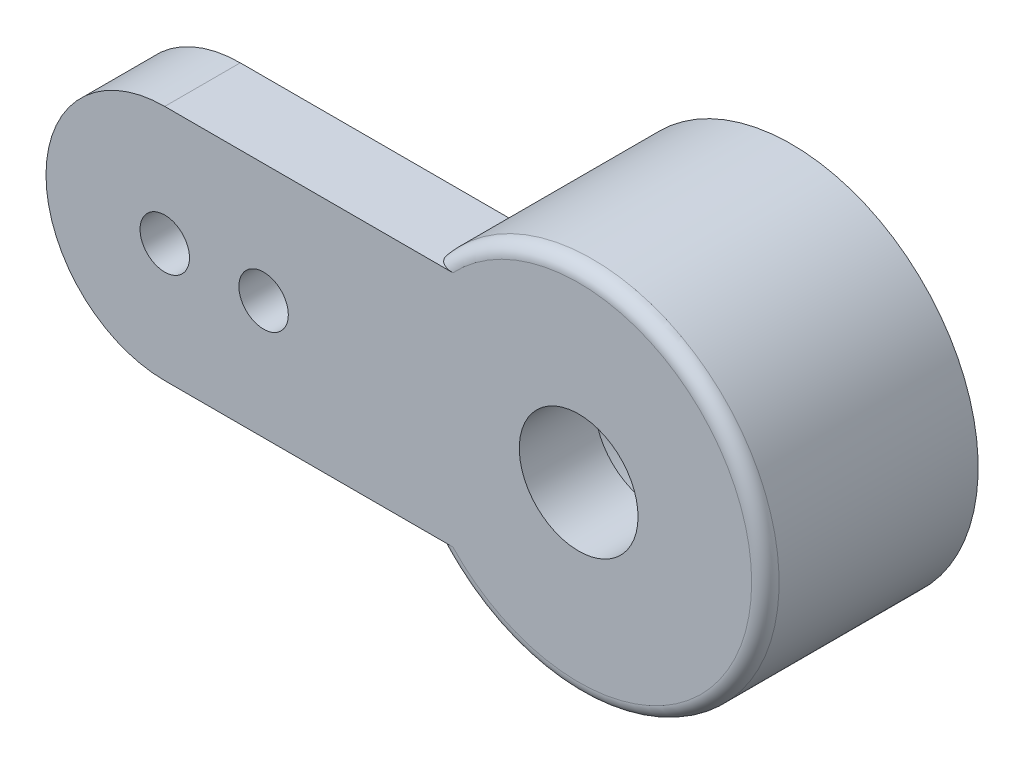
ISO-10303-21;
HEADER;
FILE_DESCRIPTION(('STEP AP214'),'2;1');
FILE_NAME('part.step','',(''),(''),'','','');
FILE_SCHEMA(('AUTOMOTIVE_DESIGN { 1 0 10303 214 1 1 1 1 }'));
ENDSEC;
DATA;
#1=APPLICATION_CONTEXT('core data for automotive mechanical design processes');
#2=APPLICATION_PROTOCOL_DEFINITION('international standard','automotive_design',2000,#1);
#3=PRODUCT_CONTEXT('',#1,'mechanical');
#4=PRODUCT('Part','Part','',(#3));
#5=PRODUCT_RELATED_PRODUCT_CATEGORY('part','',(#4));
#6=PRODUCT_DEFINITION_FORMATION('','',#4);
#7=PRODUCT_DEFINITION_CONTEXT('part definition',#1,'design');
#8=PRODUCT_DEFINITION('design','',#6,#7);
#9=PRODUCT_DEFINITION_SHAPE('','',#8);
#10=(LENGTH_UNIT() NAMED_UNIT(*) SI_UNIT(.MILLI.,.METRE.));
#11=(NAMED_UNIT(*) PLANE_ANGLE_UNIT() SI_UNIT($,.RADIAN.));
#12=(NAMED_UNIT(*) SI_UNIT($,.STERADIAN.) SOLID_ANGLE_UNIT());
#13=UNCERTAINTY_MEASURE_WITH_UNIT(LENGTH_MEASURE(1.E-05),#10,'distance_accuracy_value','');
#14=(GEOMETRIC_REPRESENTATION_CONTEXT(3) GLOBAL_UNCERTAINTY_ASSIGNED_CONTEXT((#13)) GLOBAL_UNIT_ASSIGNED_CONTEXT((#10,
#11,#12)) REPRESENTATION_CONTEXT('',''));
#15=CARTESIAN_POINT('',(0.,0.,0.));
#16=DIRECTION('',(0.,0.,1.));
#17=DIRECTION('',(1.,0.,0.));
#18=AXIS2_PLACEMENT_3D('',#15,#16,#17);
#19=CARTESIAN_POINT('',(0.,0.,0.));
#20=DIRECTION('',(0.,0.,1.));
#21=DIRECTION('',(1.,0.,0.));
#22=AXIS2_PLACEMENT_3D('',#19,#20,#21);
#23=PLANE('',#22);
#24=CARTESIAN_POINT('',(0.,0.,0.));
#25=DIRECTION('',(0.,0.,1.));
#26=DIRECTION('',(1.,0.,0.));
#27=AXIS2_PLACEMENT_3D('',#24,#25,#26);
#28=CIRCLE('',#27,0.865);
#29=CARTESIAN_POINT('',(0.865,0.,0.));
#30=VERTEX_POINT('',#29);
#31=EDGE_CURVE('E123',#30,#30,#28,.T.);
#32=ORIENTED_EDGE('',*,*,#31,.T.);
#33=EDGE_LOOP('',(#32));
#34=FACE_BOUND('',#33,.T.);
#35=CARTESIAN_POINT('',(0.,0.,0.));
#36=DIRECTION('',(0.,0.,-1.));
#37=DIRECTION('',(-1.,0.,0.));
#38=AXIS2_PLACEMENT_3D('',#35,#36,#37);
#39=CIRCLE('',#38,1.95);
#40=CARTESIAN_POINT('',(-1.95,0.,0.));
#41=VERTEX_POINT('',#40);
#42=EDGE_CURVE('E206',#41,#41,#39,.T.);
#43=ORIENTED_EDGE('',*,*,#42,.T.);
#44=EDGE_LOOP('',(#43));
#45=FACE_BOUND('',#44,.T.);
#46=ADVANCED_FACE('F37',(#34,#45),#23,.F.);
#47=CARTESIAN_POINT('',(0.,1.73,1.1));
#48=DIRECTION('',(0.,1.,0.));
#49=DIRECTION('',(0.,0.,1.));
#50=AXIS2_PLACEMENT_3D('',#47,#48,#49);
#51=PLANE('',#50);
#52=DIRECTION('',(1.,0.,0.));
#53=VECTOR('',#52,1.);
#54=CARTESIAN_POINT('',(0.,1.73,0.));
#55=LINE('',#54,#53);
#56=CARTESIAN_POINT('',(-6.03,1.73,0.));
#57=VERTEX_POINT('',#56);
#58=CARTESIAN_POINT('',(-2.09892829796542,1.73,0.));
#59=VERTEX_POINT('',#58);
#60=EDGE_CURVE('E90',#57,#59,#55,.T.);
#61=ORIENTED_EDGE('',*,*,#60,.F.);
#62=DIRECTION('',(0.,0.,-1.));
#63=VECTOR('',#62,1.);
#64=CARTESIAN_POINT('',(-6.03,1.73,1.1));
#65=LINE('',#64,#63);
#66=CARTESIAN_POINT('',(-6.03,1.73,1.1));
#67=VERTEX_POINT('',#66);
#68=EDGE_CURVE('E109',#67,#57,#65,.T.);
#69=ORIENTED_EDGE('',*,*,#68,.F.);
#70=DIRECTION('',(1.,0.,0.));
#71=VECTOR('',#70,1.);
#72=CARTESIAN_POINT('',(0.,1.73,1.1));
#73=LINE('',#72,#71);
#74=CARTESIAN_POINT('',(-1.83234822018087,1.73,1.1));
#75=VERTEX_POINT('',#74);
#76=EDGE_CURVE('E126',#67,#75,#73,.T.);
#77=ORIENTED_EDGE('',*,*,#76,.T.);
#78=CARTESIAN_POINT('',(-1.83234822018087,1.73,1.1));
#79=CARTESIAN_POINT('',(-1.84914862660356,1.73,1.09999170349791));
#80=CARTESIAN_POINT('',(-1.86598354058604,1.73,1.09887886358776));
#81=CARTESIAN_POINT('',(-1.89945426657358,1.73,1.0942693752675));
#82=CARTESIAN_POINT('',(-1.91608746178577,1.73,1.09075399873377));
#83=CARTESIAN_POINT('',(-1.94688393669079,1.73,1.08166863961151));
#84=CARTESIAN_POINT('',(-1.96112204568059,1.73,1.07635618537872));
#85=CARTESIAN_POINT('',(-1.98855857451408,1.73,1.06354998524682));
#86=CARTESIAN_POINT('',(-2.00175982236996,1.73,1.05606245431255));
#87=CARTESIAN_POINT('',(-2.02381370815452,1.73,1.04072758823927));
#88=CARTESIAN_POINT('',(-2.0329798322836,1.73,1.03333228102285));
#89=CARTESIAN_POINT('',(-2.05000748342378,1.73,1.01715625888905));
#90=CARTESIAN_POINT('',(-2.05787009745671,1.73,1.00837671036032));
#91=CARTESIAN_POINT('',(-2.07066102906721,1.73,0.991156281053392));
#92=CARTESIAN_POINT('',(-2.07586154032636,1.73,0.982918098762003));
#93=CARTESIAN_POINT('',(-2.08482175505333,1.73,0.965699043857486));
#94=CARTESIAN_POINT('',(-2.08858403669946,1.73,0.956719535633482));
#95=CARTESIAN_POINT('',(-2.09393995828107,1.73,0.939827230950006));
#96=CARTESIAN_POINT('',(-2.09579558274631,1.73,0.931997262682997));
#97=CARTESIAN_POINT('',(-2.09829696916454,1.73,0.916115281847677));
#98=CARTESIAN_POINT('',(-2.09893783168279,1.73,0.90806250244352));
#99=CARTESIAN_POINT('',(-2.09892829796542,1.73,0.9));
#100=B_SPLINE_CURVE_WITH_KNOTS('',3,(#78,#79,#80,#81,#82,#83,#84,#85,#86,#87,#88,#89,#90,#91,
#92,#93,#94,#95,#96,#97,#98,#99),.UNSPECIFIED.,.F.,.F.,(4,2,2,2,2,2,2,2,2,2,4),(0.,
0.0504208658360562,0.101239321133232,0.146666640187053,0.191965413023909,0.227169368092908,
0.26234381661386,0.29145234353568,0.32050844289208,0.344557526311704,0.368703400927188),.UNSPECIFIED.);
#101=CARTESIAN_POINT('',(-2.09892829796542,1.73,0.9));
#102=VERTEX_POINT('',#101);
#103=EDGE_CURVE('E51',#75,#102,#100,.T.);
#104=ORIENTED_EDGE('',*,*,#103,.T.);
#105=DIRECTION('',(0.,0.,-1.));
#106=VECTOR('',#105,1.);
#107=CARTESIAN_POINT('',(-2.09892829796542,1.73,1.1));
#108=LINE('',#107,#106);
#109=EDGE_CURVE('E87',#102,#59,#108,.T.);
#110=ORIENTED_EDGE('',*,*,#109,.T.);
#111=EDGE_LOOP('',(#61,#69,#77,#104,#110));
#112=FACE_BOUND('',#111,.T.);
#113=ADVANCED_FACE('F89',(#112),#51,.T.);
#114=CARTESIAN_POINT('',(-6.03,0.,1.1));
#115=DIRECTION('',(0.,0.,-1.));
#116=DIRECTION('',(-1.,0.,0.));
#117=AXIS2_PLACEMENT_3D('',#114,#115,#116);
#118=CYLINDRICAL_SURFACE('',#117,1.73);
#119=CARTESIAN_POINT('',(-6.03,0.,0.));
#120=DIRECTION('',(0.,0.,1.));
#121=DIRECTION('',(1.,0.,0.));
#122=AXIS2_PLACEMENT_3D('',#119,#120,#121);
#123=CIRCLE('',#122,1.73);
#124=CARTESIAN_POINT('',(-6.03,-1.73,0.));
#125=VERTEX_POINT('',#124);
#126=EDGE_CURVE('E103',#57,#125,#123,.T.);
#127=ORIENTED_EDGE('',*,*,#126,.T.);
#128=DIRECTION('',(0.,0.,-1.));
#129=VECTOR('',#128,1.);
#130=CARTESIAN_POINT('',(-6.03,-1.73,1.1));
#131=LINE('',#130,#129);
#132=CARTESIAN_POINT('',(-6.03,-1.73,1.1));
#133=VERTEX_POINT('',#132);
#134=EDGE_CURVE('E113',#133,#125,#131,.T.);
#135=ORIENTED_EDGE('',*,*,#134,.F.);
#136=CARTESIAN_POINT('',(-6.03,0.,1.1));
#137=DIRECTION('',(0.,0.,1.));
#138=DIRECTION('',(1.,0.,0.));
#139=AXIS2_PLACEMENT_3D('',#136,#137,#138);
#140=CIRCLE('',#139,1.73);
#141=EDGE_CURVE('E128',#67,#133,#140,.T.);
#142=ORIENTED_EDGE('',*,*,#141,.F.);
#143=ORIENTED_EDGE('',*,*,#68,.T.);
#144=EDGE_LOOP('',(#127,#135,#142,#143));
#145=FACE_BOUND('',#144,.T.);
#146=ADVANCED_FACE('F157',(#145),#118,.T.);
#147=CARTESIAN_POINT('',(0.,-1.73,1.1));
#148=DIRECTION('',(0.,1.,0.));
#149=DIRECTION('',(0.,0.,1.));
#150=AXIS2_PLACEMENT_3D('',#147,#148,#149);
#151=PLANE('',#150);
#152=DIRECTION('',(1.,0.,0.));
#153=VECTOR('',#152,1.);
#154=CARTESIAN_POINT('',(0.,-1.73,0.));
#155=LINE('',#154,#153);
#156=CARTESIAN_POINT('',(-2.09892829796542,-1.73,0.));
#157=VERTEX_POINT('',#156);
#158=EDGE_CURVE('E141',#125,#157,#155,.T.);
#159=ORIENTED_EDGE('',*,*,#158,.T.);
#160=DIRECTION('',(0.,0.,-1.));
#161=VECTOR('',#160,1.);
#162=CARTESIAN_POINT('',(-2.09892829796542,-1.73,1.1));
#163=LINE('',#162,#161);
#164=CARTESIAN_POINT('',(-2.09892829796542,-1.73,0.9));
#165=VERTEX_POINT('',#164);
#166=EDGE_CURVE('E92',#165,#157,#163,.T.);
#167=ORIENTED_EDGE('',*,*,#166,.F.);
#168=CARTESIAN_POINT('',(-2.09892829796542,-1.73,0.9));
#169=CARTESIAN_POINT('',(-2.09894642841829,-1.73,0.90940969495881));
#170=CARTESIAN_POINT('',(-2.09806905881191,-1.73,0.918802758006831));
#171=CARTESIAN_POINT('',(-2.0946758814639,-1.73,0.937226554673891));
#172=CARTESIAN_POINT('',(-2.09217094148231,-1.73,0.946259272793966));
#173=CARTESIAN_POINT('',(-2.08567729700475,-1.73,0.963749490273431));
#174=CARTESIAN_POINT('',(-2.08169118515068,-1.73,0.972207964371113));
#175=CARTESIAN_POINT('',(-2.07244822292569,-1.73,0.988408280201508));
#176=CARTESIAN_POINT('',(-2.06718926098548,-1.73,0.996148901240847));
#177=CARTESIAN_POINT('',(-2.05382878015789,-1.73,1.01307583691014));
#178=CARTESIAN_POINT('',(-2.04535154911743,-1.73,1.02196568840709));
#179=CARTESIAN_POINT('',(-2.02706406694268,-1.73,1.03824045590286));
#180=CARTESIAN_POINT('',(-2.01725203200275,-1.73,1.04562332441246));
#181=CARTESIAN_POINT('',(-1.99355345706409,-1.73,1.06091074507727));
#182=CARTESIAN_POINT('',(-1.97933289310105,-1.73,1.0682961495201));
#183=CARTESIAN_POINT('',(-1.94987568072068,-1.73,1.0806830500352));
#184=CARTESIAN_POINT('',(-1.93463673885815,-1.73,1.0856789434336));
#185=CARTESIAN_POINT('',(-1.90490583729894,-1.73,1.09311048801964));
#186=CARTESIAN_POINT('',(-1.89045728850669,-1.73,1.09572463834563));
#187=CARTESIAN_POINT('',(-1.8614494778074,-1.73,1.09916040803448));
#188=CARTESIAN_POINT('',(-1.84689171477545,-1.73,1.09999453603148));
#189=CARTESIAN_POINT('',(-1.83234822018087,-1.73,1.1));
#190=B_SPLINE_CURVE_WITH_KNOTS('',3,(#168,#169,#170,#171,#172,#173,#174,#175,#176,#177,#178,
#179,#180,#181,#182,#183,#184,#185,#186,#187,#188,#189),.UNSPECIFIED.,.F.,.F.,(4,2,2,2,2,2,2,2,
2,2,4),(0.,0.0281619305193012,0.0561377217742335,0.0840647731517108,0.112038474982948,
0.148690314604594,0.185391625208961,0.233207897682934,0.281135741688055,0.325074055030522,
0.368702572715453),.UNSPECIFIED.);
#191=CARTESIAN_POINT('',(-1.83234822018087,-1.73,1.1));
#192=VERTEX_POINT('',#191);
#193=EDGE_CURVE('E11',#165,#192,#190,.T.);
#194=ORIENTED_EDGE('',*,*,#193,.T.);
#195=DIRECTION('',(1.,0.,0.));
#196=VECTOR('',#195,1.);
#197=CARTESIAN_POINT('',(0.,-1.73,1.1));
#198=LINE('',#197,#196);
#199=EDGE_CURVE('E131',#133,#192,#198,.T.);
#200=ORIENTED_EDGE('',*,*,#199,.F.);
#201=ORIENTED_EDGE('',*,*,#134,.T.);
#202=EDGE_LOOP('',(#159,#167,#194,#200,#201));
#203=FACE_BOUND('',#202,.T.);
#204=ADVANCED_FACE('F212',(#203),#151,.F.);
#205=CARTESIAN_POINT('',(0.,0.,1.1));
#206=DIRECTION('',(0.,0.,-1.));
#207=DIRECTION('',(-1.,0.,0.));
#208=AXIS2_PLACEMENT_3D('',#205,#206,#207);
#209=CYLINDRICAL_SURFACE('',#208,2.72);
#210=ORIENTED_EDGE('',*,*,#109,.F.);
#211=CARTESIAN_POINT('',(0.,0.,0.9));
#212=DIRECTION('',(0.,0.,1.));
#213=DIRECTION('',(1.,0.,0.));
#214=AXIS2_PLACEMENT_3D('',#211,#212,#213);
#215=CIRCLE('',#214,2.72);
#216=EDGE_CURVE('E64',#102,#165,#215,.F.);
#217=ORIENTED_EDGE('',*,*,#216,.T.);
#218=ORIENTED_EDGE('',*,*,#166,.T.);
#219=CARTESIAN_POINT('',(0.,0.,0.));
#220=DIRECTION('',(0.,0.,-1.));
#221=DIRECTION('',(-1.,0.,0.));
#222=AXIS2_PLACEMENT_3D('',#219,#220,#221);
#223=CIRCLE('',#222,2.72);
#224=EDGE_CURVE('E100',#157,#59,#223,.T.);
#225=ORIENTED_EDGE('',*,*,#224,.T.);
#226=EDGE_LOOP('',(#210,#217,#218,#225));
#227=FACE_BOUND('',#226,.T.);
#228=CARTESIAN_POINT('',(0.,0.,-2.));
#229=DIRECTION('',(0.,0.,-1.));
#230=DIRECTION('',(-1.,0.,0.));
#231=AXIS2_PLACEMENT_3D('',#228,#229,#230);
#232=CIRCLE('',#231,2.72);
#233=CARTESIAN_POINT('',(-2.72,0.,-2.));
#234=VERTEX_POINT('',#233);
#235=EDGE_CURVE('E117',#234,#234,#232,.T.);
#236=ORIENTED_EDGE('',*,*,#235,.F.);
#237=EDGE_LOOP('',(#236));
#238=FACE_BOUND('',#237,.T.);
#239=ADVANCED_FACE('F106',(#227,#238),#209,.T.);
#240=CARTESIAN_POINT('',(-6.03,0.,1.1));
#241=DIRECTION('',(0.,0.,-1.));
#242=DIRECTION('',(-1.,0.,0.));
#243=AXIS2_PLACEMENT_3D('',#240,#241,#242);
#244=CYLINDRICAL_SURFACE('',#243,0.36);
#245=CARTESIAN_POINT('',(-6.03,0.,1.1));
#246=DIRECTION('',(0.,0.,1.));
#247=DIRECTION('',(1.,0.,0.));
#248=AXIS2_PLACEMENT_3D('',#245,#246,#247);
#249=CIRCLE('',#248,0.36);
#250=CARTESIAN_POINT('',(-5.67,0.,1.1));
#251=VERTEX_POINT('',#250);
#252=EDGE_CURVE('E122',#251,#251,#249,.T.);
#253=ORIENTED_EDGE('',*,*,#252,.T.);
#254=EDGE_LOOP('',(#253));
#255=FACE_BOUND('',#254,.T.);
#256=CARTESIAN_POINT('',(-6.03,0.,0.));
#257=DIRECTION('',(0.,0.,1.));
#258=DIRECTION('',(1.,0.,0.));
#259=AXIS2_PLACEMENT_3D('',#256,#257,#258);
#260=CIRCLE('',#259,0.36);
#261=CARTESIAN_POINT('',(-5.67,0.,0.));
#262=VERTEX_POINT('',#261);
#263=EDGE_CURVE('E104',#262,#262,#260,.T.);
#264=ORIENTED_EDGE('',*,*,#263,.F.);
#265=EDGE_LOOP('',(#264));
#266=FACE_BOUND('',#265,.T.);
#267=ADVANCED_FACE('F158',(#255,#266),#244,.F.);
#268=CARTESIAN_POINT('',(-4.59,0.,1.1));
#269=DIRECTION('',(0.,0.,-1.));
#270=DIRECTION('',(-1.,0.,0.));
#271=AXIS2_PLACEMENT_3D('',#268,#269,#270);
#272=CYLINDRICAL_SURFACE('',#271,0.36);
#273=CARTESIAN_POINT('',(-4.59,0.,1.1));
#274=DIRECTION('',(0.,0.,1.));
#275=DIRECTION('',(1.,0.,0.));
#276=AXIS2_PLACEMENT_3D('',#273,#274,#275);
#277=CIRCLE('',#276,0.36);
#278=CARTESIAN_POINT('',(-4.23,0.,1.1));
#279=VERTEX_POINT('',#278);
#280=EDGE_CURVE('E119',#279,#279,#277,.T.);
#281=ORIENTED_EDGE('',*,*,#280,.T.);
#282=EDGE_LOOP('',(#281));
#283=FACE_BOUND('',#282,.T.);
#284=CARTESIAN_POINT('',(-4.59,0.,0.));
#285=DIRECTION('',(0.,0.,1.));
#286=DIRECTION('',(1.,0.,0.));
#287=AXIS2_PLACEMENT_3D('',#284,#285,#286);
#288=CIRCLE('',#287,0.36);
#289=CARTESIAN_POINT('',(-4.23,0.,0.));
#290=VERTEX_POINT('',#289);
#291=EDGE_CURVE('E135',#290,#290,#288,.T.);
#292=ORIENTED_EDGE('',*,*,#291,.F.);
#293=EDGE_LOOP('',(#292));
#294=FACE_BOUND('',#293,.T.);
#295=ADVANCED_FACE('F160',(#283,#294),#272,.F.);
#296=CARTESIAN_POINT('',(0.,0.,1.1));
#297=DIRECTION('',(0.,0.,-1.));
#298=DIRECTION('',(-1.,0.,0.));
#299=AXIS2_PLACEMENT_3D('',#296,#297,#298);
#300=CYLINDRICAL_SURFACE('',#299,0.865);
#301=CARTESIAN_POINT('',(0.,0.,1.1));
#302=DIRECTION('',(0.,0.,1.));
#303=DIRECTION('',(1.,0.,0.));
#304=AXIS2_PLACEMENT_3D('',#301,#302,#303);
#305=CIRCLE('',#304,0.865);
#306=CARTESIAN_POINT('',(0.865,0.,1.1));
#307=VERTEX_POINT('',#306);
#308=EDGE_CURVE('E93',#307,#307,#305,.T.);
#309=ORIENTED_EDGE('',*,*,#308,.T.);
#310=EDGE_LOOP('',(#309));
#311=FACE_BOUND('',#310,.T.);
#312=ORIENTED_EDGE('',*,*,#31,.F.);
#313=EDGE_LOOP('',(#312));
#314=FACE_BOUND('',#313,.T.);
#315=ADVANCED_FACE('F163',(#311,#314),#300,.F.);
#316=CARTESIAN_POINT('',(0.,0.,1.1));
#317=DIRECTION('',(0.,0.,1.));
#318=DIRECTION('',(1.,0.,0.));
#319=AXIS2_PLACEMENT_3D('',#316,#317,#318);
#320=PLANE('',#319);
#321=ORIENTED_EDGE('',*,*,#280,.F.);
#322=EDGE_LOOP('',(#321));
#323=FACE_BOUND('',#322,.T.);
#324=ORIENTED_EDGE('',*,*,#252,.F.);
#325=EDGE_LOOP('',(#324));
#326=FACE_BOUND('',#325,.T.);
#327=CARTESIAN_POINT('',(0.,0.,1.1));
#328=DIRECTION('',(0.,0.,1.));
#329=DIRECTION('',(1.,0.,0.));
#330=AXIS2_PLACEMENT_3D('',#327,#328,#329);
#331=CIRCLE('',#330,2.52);
#332=EDGE_CURVE('E108',#192,#75,#331,.T.);
#333=ORIENTED_EDGE('',*,*,#332,.T.);
#334=ORIENTED_EDGE('',*,*,#76,.F.);
#335=ORIENTED_EDGE('',*,*,#141,.T.);
#336=ORIENTED_EDGE('',*,*,#199,.T.);
#337=EDGE_LOOP('',(#333,#334,#335,#336));
#338=FACE_BOUND('',#337,.T.);
#339=ORIENTED_EDGE('',*,*,#308,.F.);
#340=EDGE_LOOP('',(#339));
#341=FACE_BOUND('',#340,.T.);
#342=ADVANCED_FACE('F168',(#323,#326,#338,#341),#320,.T.);
#343=ORIENTED_EDGE('',*,*,#224,.F.);
#344=ORIENTED_EDGE('',*,*,#158,.F.);
#345=ORIENTED_EDGE('',*,*,#126,.F.);
#346=ORIENTED_EDGE('',*,*,#60,.T.);
#347=EDGE_LOOP('',(#343,#344,#345,#346));
#348=FACE_BOUND('',#347,.T.);
#349=ORIENTED_EDGE('',*,*,#291,.T.);
#350=EDGE_LOOP('',(#349));
#351=FACE_BOUND('',#350,.T.);
#352=ORIENTED_EDGE('',*,*,#263,.T.);
#353=EDGE_LOOP('',(#352));
#354=FACE_BOUND('',#353,.T.);
#355=ADVANCED_FACE('F98',(#348,#351,#354),#23,.F.);
#356=CARTESIAN_POINT('',(0.,0.,-2.));
#357=DIRECTION('',(0.,0.,-1.));
#358=DIRECTION('',(-1.,0.,0.));
#359=AXIS2_PLACEMENT_3D('',#356,#357,#358);
#360=PLANE('',#359);
#361=ORIENTED_EDGE('',*,*,#235,.T.);
#362=EDGE_LOOP('',(#361));
#363=FACE_BOUND('',#362,.T.);
#364=CARTESIAN_POINT('',(0.,0.,-2.));
#365=DIRECTION('',(0.,0.,-1.));
#366=DIRECTION('',(-1.,0.,0.));
#367=AXIS2_PLACEMENT_3D('',#364,#365,#366);
#368=CIRCLE('',#367,1.95);
#369=CARTESIAN_POINT('',(-1.95,0.,-2.));
#370=VERTEX_POINT('',#369);
#371=EDGE_CURVE('E203',#370,#370,#368,.T.);
#372=ORIENTED_EDGE('',*,*,#371,.F.);
#373=EDGE_LOOP('',(#372));
#374=FACE_BOUND('',#373,.T.);
#375=ADVANCED_FACE('F180',(#363,#374),#360,.T.);
#376=CARTESIAN_POINT('',(0.,0.,-2.));
#377=DIRECTION('',(0.,0.,1.));
#378=DIRECTION('',(1.,0.,0.));
#379=AXIS2_PLACEMENT_3D('',#376,#377,#378);
#380=CYLINDRICAL_SURFACE('',#379,1.95);
#381=ORIENTED_EDGE('',*,*,#371,.T.);
#382=EDGE_LOOP('',(#381));
#383=FACE_BOUND('',#382,.T.);
#384=ORIENTED_EDGE('',*,*,#42,.F.);
#385=EDGE_LOOP('',(#384));
#386=FACE_BOUND('',#385,.T.);
#387=ADVANCED_FACE('F185',(#383,#386),#380,.F.);
#388=CARTESIAN_POINT('',(0.,0.,0.9));
#389=DIRECTION('',(0.,0.,1.));
#390=DIRECTION('',(1.,0.,0.));
#391=AXIS2_PLACEMENT_3D('',#388,#389,#390);
#392=TOROIDAL_SURFACE('',#391,2.52,0.2);
#393=ORIENTED_EDGE('',*,*,#193,.F.);
#394=ORIENTED_EDGE('',*,*,#216,.F.);
#395=ORIENTED_EDGE('',*,*,#103,.F.);
#396=ORIENTED_EDGE('',*,*,#332,.F.);
#397=EDGE_LOOP('',(#393,#394,#395,#396));
#398=FACE_BOUND('',#397,.T.);
#399=ADVANCED_FACE('F39',(#398),#392,.T.);
#400=CLOSED_SHELL('',(#46,#113,#146,#204,#239,#267,#295,#315,#342,#355,#375,#387,#399));
#401=MANIFOLD_SOLID_BREP('B2',#400);
#402=ADVANCED_BREP_SHAPE_REPRESENTATION('',(#18,#401),#14);
#403=SHAPE_DEFINITION_REPRESENTATION(#9,#402);
ENDSEC;
END-ISO-10303-21;
